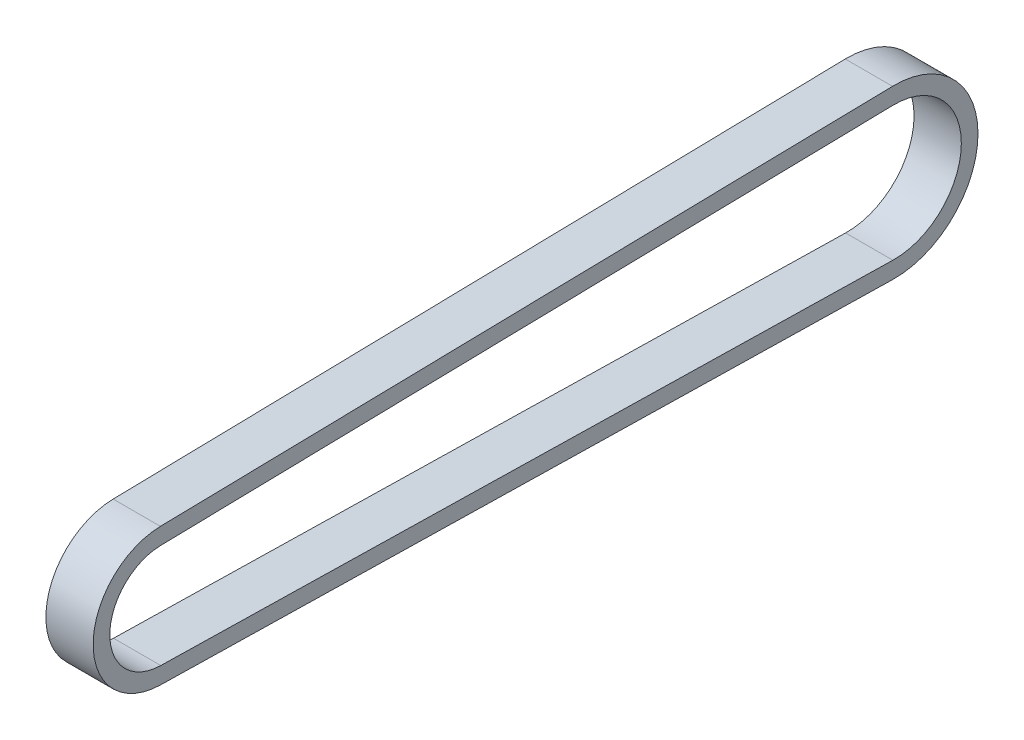
ISO-10303-21;
HEADER;
FILE_DESCRIPTION(('STEP AP214'),'2;1');
FILE_NAME('part.step','',(''),(''),'','','');
FILE_SCHEMA(('AUTOMOTIVE_DESIGN { 1 0 10303 214 1 1 1 1 }'));
ENDSEC;
DATA;
#1=APPLICATION_CONTEXT('core data for automotive mechanical design processes');
#2=APPLICATION_PROTOCOL_DEFINITION('international standard','automotive_design',2000,#1);
#3=PRODUCT_CONTEXT('',#1,'mechanical');
#4=PRODUCT('Part','Part','',(#3));
#5=PRODUCT_RELATED_PRODUCT_CATEGORY('part','',(#4));
#6=PRODUCT_DEFINITION_FORMATION('','',#4);
#7=PRODUCT_DEFINITION_CONTEXT('part definition',#1,'design');
#8=PRODUCT_DEFINITION('design','',#6,#7);
#9=PRODUCT_DEFINITION_SHAPE('','',#8);
#10=(LENGTH_UNIT() NAMED_UNIT(*) SI_UNIT(.MILLI.,.METRE.));
#11=(NAMED_UNIT(*) PLANE_ANGLE_UNIT() SI_UNIT($,.RADIAN.));
#12=(NAMED_UNIT(*) SI_UNIT($,.STERADIAN.) SOLID_ANGLE_UNIT());
#13=UNCERTAINTY_MEASURE_WITH_UNIT(LENGTH_MEASURE(1.E-05),#10,'distance_accuracy_value','');
#14=(GEOMETRIC_REPRESENTATION_CONTEXT(3) GLOBAL_UNCERTAINTY_ASSIGNED_CONTEXT((#13)) GLOBAL_UNIT_ASSIGNED_CONTEXT((#10,
#11,#12)) REPRESENTATION_CONTEXT('',''));
#15=CARTESIAN_POINT('',(0.,0.,0.));
#16=DIRECTION('',(0.,0.,1.));
#17=DIRECTION('',(1.,0.,0.));
#18=AXIS2_PLACEMENT_3D('',#15,#16,#17);
#19=CARTESIAN_POINT('',(4.5,0.,0.));
#20=DIRECTION('',(1.,0.,0.));
#21=DIRECTION('',(0.,0.,-1.));
#22=AXIS2_PLACEMENT_3D('',#19,#20,#21);
#23=PLANE('',#22);
#24=CARTESIAN_POINT('',(4.5,0.,0.));
#25=DIRECTION('',(1.,0.,0.));
#26=DIRECTION('',(0.,0.,-1.));
#27=AXIS2_PLACEMENT_3D('',#24,#25,#26);
#28=CIRCLE('',#27,13.08354);
#29=CARTESIAN_POINT('',(4.5,13.0807790635629,0.268771318885449));
#30=VERTEX_POINT('',#29);
#31=CARTESIAN_POINT('',(4.5,-13.0807790635629,0.268771318885449));
#32=VERTEX_POINT('',#31);
#33=EDGE_CURVE('E139',#30,#32,#28,.T.);
#34=ORIENTED_EDGE('',*,*,#33,.T.);
#35=DIRECTION('',(0.,-0.0205427062465853,-0.999788976344542));
#36=VECTOR('',#35,1.);
#37=CARTESIAN_POINT('',(4.5,-13.0807790635629,0.268771318885449));
#38=LINE('',#37,#36);
#39=CARTESIAN_POINT('',(4.5,-15.9452944554671,-139.143771362593));
#40=VERTEX_POINT('',#39);
#41=EDGE_CURVE('E142',#32,#40,#38,.T.);
#42=ORIENTED_EDGE('',*,*,#41,.T.);
#43=CARTESIAN_POINT('',(4.5,0.,-139.4714));
#44=DIRECTION('',(1.,0.,0.));
#45=DIRECTION('',(0.,0.,-1.));
#46=AXIS2_PLACEMENT_3D('',#43,#44,#45);
#47=CIRCLE('',#46,15.94866);
#48=CARTESIAN_POINT('',(4.5,15.9452944554671,-139.143771362593));
#49=VERTEX_POINT('',#48);
#50=EDGE_CURVE('E145',#40,#49,#47,.T.);
#51=ORIENTED_EDGE('',*,*,#50,.T.);
#52=DIRECTION('',(0.,-0.0205427062465853,0.999788976344542));
#53=VECTOR('',#52,1.);
#54=CARTESIAN_POINT('',(4.5,13.0807790635629,0.268771318885449));
#55=LINE('',#54,#53);
#56=EDGE_CURVE('E147',#49,#30,#55,.T.);
#57=ORIENTED_EDGE('',*,*,#56,.T.);
#58=EDGE_LOOP('',(#34,#42,#51,#57));
#59=FACE_BOUND('',#58,.T.);
#60=DIRECTION('',(0.,-0.0205427062465853,-0.999788976344542));
#61=VECTOR('',#60,1.);
#62=CARTESIAN_POINT('',(4.5,-9.90644906366895,0.203548226552541));
#63=LINE('',#62,#61);
#64=CARTESIAN_POINT('',(4.5,-9.90644906366895,0.203548226552541));
#65=VERTEX_POINT('',#64);
#66=CARTESIAN_POINT('',(4.5,-12.7709644555732,-139.208994454926));
#67=VERTEX_POINT('',#66);
#68=EDGE_CURVE('E111',#65,#67,#63,.T.);
#69=ORIENTED_EDGE('',*,*,#68,.F.);
#70=CARTESIAN_POINT('',(4.5,0.,0.));
#71=DIRECTION('',(1.,0.,0.));
#72=DIRECTION('',(0.,0.,-1.));
#73=AXIS2_PLACEMENT_3D('',#70,#71,#72);
#74=CIRCLE('',#73,9.90854);
#75=CARTESIAN_POINT('',(4.5,9.90644906366895,0.203548226552541));
#76=VERTEX_POINT('',#75);
#77=EDGE_CURVE('E103',#76,#65,#74,.T.);
#78=ORIENTED_EDGE('',*,*,#77,.F.);
#79=DIRECTION('',(0.,-0.0205427062465853,0.999788976344542));
#80=VECTOR('',#79,1.);
#81=CARTESIAN_POINT('',(4.5,9.90644906366895,0.203548226552541));
#82=LINE('',#81,#80);
#83=CARTESIAN_POINT('',(4.5,12.7709644555732,-139.208994454926));
#84=VERTEX_POINT('',#83);
#85=EDGE_CURVE('E125',#84,#76,#82,.T.);
#86=ORIENTED_EDGE('',*,*,#85,.F.);
#87=CARTESIAN_POINT('',(4.5,0.,-139.4714));
#88=DIRECTION('',(1.,0.,0.));
#89=DIRECTION('',(0.,0.,-1.));
#90=AXIS2_PLACEMENT_3D('',#87,#88,#89);
#91=CIRCLE('',#90,12.77366);
#92=EDGE_CURVE('E123',#67,#84,#91,.T.);
#93=ORIENTED_EDGE('',*,*,#92,.F.);
#94=EDGE_LOOP('',(#69,#78,#86,#93));
#95=FACE_BOUND('',#94,.T.);
#96=ADVANCED_FACE('F38',(#59,#95),#23,.T.);
#97=CARTESIAN_POINT('',(-4.5,0.,0.));
#98=DIRECTION('',(1.,0.,0.));
#99=DIRECTION('',(0.,0.,-1.));
#100=AXIS2_PLACEMENT_3D('',#97,#98,#99);
#101=PLANE('',#100);
#102=CARTESIAN_POINT('',(-4.5,0.,0.));
#103=DIRECTION('',(1.,0.,0.));
#104=DIRECTION('',(0.,0.,-1.));
#105=AXIS2_PLACEMENT_3D('',#102,#103,#104);
#106=CIRCLE('',#105,13.08354);
#107=CARTESIAN_POINT('',(-4.5,13.0807790635629,0.268771318885449));
#108=VERTEX_POINT('',#107);
#109=CARTESIAN_POINT('',(-4.5,-13.0807790635629,0.268771318885449));
#110=VERTEX_POINT('',#109);
#111=EDGE_CURVE('E119',#108,#110,#106,.T.);
#112=ORIENTED_EDGE('',*,*,#111,.F.);
#113=DIRECTION('',(0.,-0.0205427062465853,0.999788976344542));
#114=VECTOR('',#113,1.);
#115=CARTESIAN_POINT('',(-4.5,13.0807790635629,0.268771318885449));
#116=LINE('',#115,#114);
#117=CARTESIAN_POINT('',(-4.5,15.9452944554671,-139.143771362593));
#118=VERTEX_POINT('',#117);
#119=EDGE_CURVE('E143',#118,#108,#116,.T.);
#120=ORIENTED_EDGE('',*,*,#119,.F.);
#121=CARTESIAN_POINT('',(-4.5,0.,-139.4714));
#122=DIRECTION('',(1.,0.,0.));
#123=DIRECTION('',(0.,0.,-1.));
#124=AXIS2_PLACEMENT_3D('',#121,#122,#123);
#125=CIRCLE('',#124,15.94866);
#126=CARTESIAN_POINT('',(-4.5,-15.9452944554671,-139.143771362593));
#127=VERTEX_POINT('',#126);
#128=EDGE_CURVE('E154',#127,#118,#125,.T.);
#129=ORIENTED_EDGE('',*,*,#128,.F.);
#130=DIRECTION('',(0.,-0.0205427062465853,-0.999788976344542));
#131=VECTOR('',#130,1.);
#132=CARTESIAN_POINT('',(-4.5,-13.0807790635629,0.268771318885449));
#133=LINE('',#132,#131);
#134=EDGE_CURVE('E152',#110,#127,#133,.T.);
#135=ORIENTED_EDGE('',*,*,#134,.F.);
#136=EDGE_LOOP('',(#112,#120,#129,#135));
#137=FACE_BOUND('',#136,.T.);
#138=CARTESIAN_POINT('',(-4.5,0.,0.));
#139=DIRECTION('',(1.,0.,0.));
#140=DIRECTION('',(0.,0.,-1.));
#141=AXIS2_PLACEMENT_3D('',#138,#139,#140);
#142=CIRCLE('',#141,9.90854);
#143=CARTESIAN_POINT('',(-4.5,9.90644906366894,0.203548226552541));
#144=VERTEX_POINT('',#143);
#145=CARTESIAN_POINT('',(-4.5,-9.90644906366895,0.203548226552541));
#146=VERTEX_POINT('',#145);
#147=EDGE_CURVE('E61',#144,#146,#142,.T.);
#148=ORIENTED_EDGE('',*,*,#147,.T.);
#149=DIRECTION('',(0.,-0.0205427062465853,-0.999788976344542));
#150=VECTOR('',#149,1.);
#151=CARTESIAN_POINT('',(-4.5,-9.90644906366895,0.203548226552541));
#152=LINE('',#151,#150);
#153=CARTESIAN_POINT('',(-4.5,-12.7709644555732,-139.208994454926));
#154=VERTEX_POINT('',#153);
#155=EDGE_CURVE('E118',#146,#154,#152,.T.);
#156=ORIENTED_EDGE('',*,*,#155,.T.);
#157=CARTESIAN_POINT('',(-4.5,0.,-139.4714));
#158=DIRECTION('',(1.,0.,0.));
#159=DIRECTION('',(0.,0.,-1.));
#160=AXIS2_PLACEMENT_3D('',#157,#158,#159);
#161=CIRCLE('',#160,12.77366);
#162=CARTESIAN_POINT('',(-4.5,12.7709644555732,-139.208994454926));
#163=VERTEX_POINT('',#162);
#164=EDGE_CURVE('E131',#154,#163,#161,.T.);
#165=ORIENTED_EDGE('',*,*,#164,.T.);
#166=DIRECTION('',(0.,-0.0205427062465853,0.999788976344542));
#167=VECTOR('',#166,1.);
#168=CARTESIAN_POINT('',(-4.5,9.90644906366895,0.203548226552541));
#169=LINE('',#168,#167);
#170=EDGE_CURVE('E112',#163,#144,#169,.T.);
#171=ORIENTED_EDGE('',*,*,#170,.T.);
#172=EDGE_LOOP('',(#148,#156,#165,#171));
#173=FACE_BOUND('',#172,.T.);
#174=ADVANCED_FACE('F172',(#137,#173),#101,.F.);
#175=CARTESIAN_POINT('',(4.5,0.,0.));
#176=DIRECTION('',(-1.,0.,0.));
#177=DIRECTION('',(0.,0.,1.));
#178=AXIS2_PLACEMENT_3D('',#175,#176,#177);
#179=CYLINDRICAL_SURFACE('',#178,13.08354);
#180=ORIENTED_EDGE('',*,*,#111,.T.);
#181=DIRECTION('',(-1.,0.,0.));
#182=VECTOR('',#181,1.);
#183=CARTESIAN_POINT('',(4.5,-13.0807790635629,0.268771318885449));
#184=LINE('',#183,#182);
#185=EDGE_CURVE('E11',#32,#110,#184,.T.);
#186=ORIENTED_EDGE('',*,*,#185,.F.);
#187=ORIENTED_EDGE('',*,*,#33,.F.);
#188=DIRECTION('',(-1.,0.,0.));
#189=VECTOR('',#188,1.);
#190=CARTESIAN_POINT('',(4.5,13.0807790635629,0.268771318885449));
#191=LINE('',#190,#189);
#192=EDGE_CURVE('E149',#30,#108,#191,.T.);
#193=ORIENTED_EDGE('',*,*,#192,.T.);
#194=EDGE_LOOP('',(#180,#186,#187,#193));
#195=FACE_BOUND('',#194,.T.);
#196=ADVANCED_FACE('F40',(#195),#179,.T.);
#197=CARTESIAN_POINT('',(4.5,-13.0807790635629,0.268771318885449));
#198=DIRECTION('',(0.,0.999788976344542,-0.0205427062465853));
#199=DIRECTION('',(0.,0.0205427062465853,0.999788976344542));
#200=AXIS2_PLACEMENT_3D('',#197,#198,#199);
#201=PLANE('',#200);
#202=ORIENTED_EDGE('',*,*,#134,.T.);
#203=DIRECTION('',(-1.,0.,0.));
#204=VECTOR('',#203,1.);
#205=CARTESIAN_POINT('',(4.5,-15.9452944554671,-139.143771362593));
#206=LINE('',#205,#204);
#207=EDGE_CURVE('E46',#40,#127,#206,.T.);
#208=ORIENTED_EDGE('',*,*,#207,.F.);
#209=ORIENTED_EDGE('',*,*,#41,.F.);
#210=ORIENTED_EDGE('',*,*,#185,.T.);
#211=EDGE_LOOP('',(#202,#208,#209,#210));
#212=FACE_BOUND('',#211,.T.);
#213=ADVANCED_FACE('F182',(#212),#201,.F.);
#214=CARTESIAN_POINT('',(4.5,0.,-139.4714));
#215=DIRECTION('',(-1.,0.,0.));
#216=DIRECTION('',(0.,0.,1.));
#217=AXIS2_PLACEMENT_3D('',#214,#215,#216);
#218=CYLINDRICAL_SURFACE('',#217,15.94866);
#219=ORIENTED_EDGE('',*,*,#128,.T.);
#220=DIRECTION('',(-1.,0.,0.));
#221=VECTOR('',#220,1.);
#222=CARTESIAN_POINT('',(4.5,15.9452944554671,-139.143771362593));
#223=LINE('',#222,#221);
#224=EDGE_CURVE('E159',#49,#118,#223,.T.);
#225=ORIENTED_EDGE('',*,*,#224,.F.);
#226=ORIENTED_EDGE('',*,*,#50,.F.);
#227=ORIENTED_EDGE('',*,*,#207,.T.);
#228=EDGE_LOOP('',(#219,#225,#226,#227));
#229=FACE_BOUND('',#228,.T.);
#230=ADVANCED_FACE('F166',(#229),#218,.T.);
#231=CARTESIAN_POINT('',(4.5,13.0807790635629,0.268771318885449));
#232=DIRECTION('',(0.,-0.999788976344542,-0.0205427062465853));
#233=DIRECTION('',(0.,0.0205427062465853,-0.999788976344542));
#234=AXIS2_PLACEMENT_3D('',#231,#232,#233);
#235=PLANE('',#234);
#236=ORIENTED_EDGE('',*,*,#119,.T.);
#237=ORIENTED_EDGE('',*,*,#192,.F.);
#238=ORIENTED_EDGE('',*,*,#56,.F.);
#239=ORIENTED_EDGE('',*,*,#224,.T.);
#240=EDGE_LOOP('',(#236,#237,#238,#239));
#241=FACE_BOUND('',#240,.T.);
#242=ADVANCED_FACE('F176',(#241),#235,.F.);
#243=CARTESIAN_POINT('',(4.5,0.,0.));
#244=DIRECTION('',(-1.,0.,0.));
#245=DIRECTION('',(0.,0.,1.));
#246=AXIS2_PLACEMENT_3D('',#243,#244,#245);
#247=CYLINDRICAL_SURFACE('',#246,9.90854);
#248=ORIENTED_EDGE('',*,*,#147,.F.);
#249=DIRECTION('',(-1.,0.,0.));
#250=VECTOR('',#249,1.);
#251=CARTESIAN_POINT('',(4.5,9.90644906366895,0.203548226552541));
#252=LINE('',#251,#250);
#253=EDGE_CURVE('E107',#76,#144,#252,.T.);
#254=ORIENTED_EDGE('',*,*,#253,.F.);
#255=ORIENTED_EDGE('',*,*,#77,.T.);
#256=DIRECTION('',(-1.,0.,0.));
#257=VECTOR('',#256,1.);
#258=CARTESIAN_POINT('',(4.5,-9.90644906366895,0.203548226552541));
#259=LINE('',#258,#257);
#260=EDGE_CURVE('E106',#65,#146,#259,.T.);
#261=ORIENTED_EDGE('',*,*,#260,.T.);
#262=EDGE_LOOP('',(#248,#254,#255,#261));
#263=FACE_BOUND('',#262,.T.);
#264=ADVANCED_FACE('F105',(#263),#247,.F.);
#265=CARTESIAN_POINT('',(4.5,-9.90644906366895,0.203548226552541));
#266=DIRECTION('',(0.,0.999788976344542,-0.0205427062465853));
#267=DIRECTION('',(0.,0.0205427062465853,0.999788976344542));
#268=AXIS2_PLACEMENT_3D('',#265,#266,#267);
#269=PLANE('',#268);
#270=ORIENTED_EDGE('',*,*,#155,.F.);
#271=ORIENTED_EDGE('',*,*,#260,.F.);
#272=ORIENTED_EDGE('',*,*,#68,.T.);
#273=DIRECTION('',(-1.,0.,0.));
#274=VECTOR('',#273,1.);
#275=CARTESIAN_POINT('',(4.5,-12.7709644555732,-139.208994454926));
#276=LINE('',#275,#274);
#277=EDGE_CURVE('E120',#67,#154,#276,.T.);
#278=ORIENTED_EDGE('',*,*,#277,.T.);
#279=EDGE_LOOP('',(#270,#271,#272,#278));
#280=FACE_BOUND('',#279,.T.);
#281=ADVANCED_FACE('F115',(#280),#269,.T.);
#282=CARTESIAN_POINT('',(4.5,0.,-139.4714));
#283=DIRECTION('',(-1.,0.,0.));
#284=DIRECTION('',(0.,0.,1.));
#285=AXIS2_PLACEMENT_3D('',#282,#283,#284);
#286=CYLINDRICAL_SURFACE('',#285,12.77366);
#287=ORIENTED_EDGE('',*,*,#164,.F.);
#288=ORIENTED_EDGE('',*,*,#277,.F.);
#289=ORIENTED_EDGE('',*,*,#92,.T.);
#290=DIRECTION('',(-1.,0.,0.));
#291=VECTOR('',#290,1.);
#292=CARTESIAN_POINT('',(4.5,12.7709644555732,-139.208994454926));
#293=LINE('',#292,#291);
#294=EDGE_CURVE('E53',#84,#163,#293,.T.);
#295=ORIENTED_EDGE('',*,*,#294,.T.);
#296=EDGE_LOOP('',(#287,#288,#289,#295));
#297=FACE_BOUND('',#296,.T.);
#298=ADVANCED_FACE('F205',(#297),#286,.F.);
#299=CARTESIAN_POINT('',(4.5,9.90644906366895,0.203548226552541));
#300=DIRECTION('',(0.,-0.999788976344542,-0.0205427062465853));
#301=DIRECTION('',(0.,0.0205427062465853,-0.999788976344542));
#302=AXIS2_PLACEMENT_3D('',#299,#300,#301);
#303=PLANE('',#302);
#304=ORIENTED_EDGE('',*,*,#170,.F.);
#305=ORIENTED_EDGE('',*,*,#294,.F.);
#306=ORIENTED_EDGE('',*,*,#85,.T.);
#307=ORIENTED_EDGE('',*,*,#253,.T.);
#308=EDGE_LOOP('',(#304,#305,#306,#307));
#309=FACE_BOUND('',#308,.T.);
#310=ADVANCED_FACE('F209',(#309),#303,.T.);
#311=CLOSED_SHELL('',(#96,#174,#196,#213,#230,#242,#264,#281,#298,#310));
#312=MANIFOLD_SOLID_BREP('B2',#311);
#313=ADVANCED_BREP_SHAPE_REPRESENTATION('',(#18,#312),#14);
#314=SHAPE_DEFINITION_REPRESENTATION(#9,#313);
ENDSEC;
END-ISO-10303-21;
